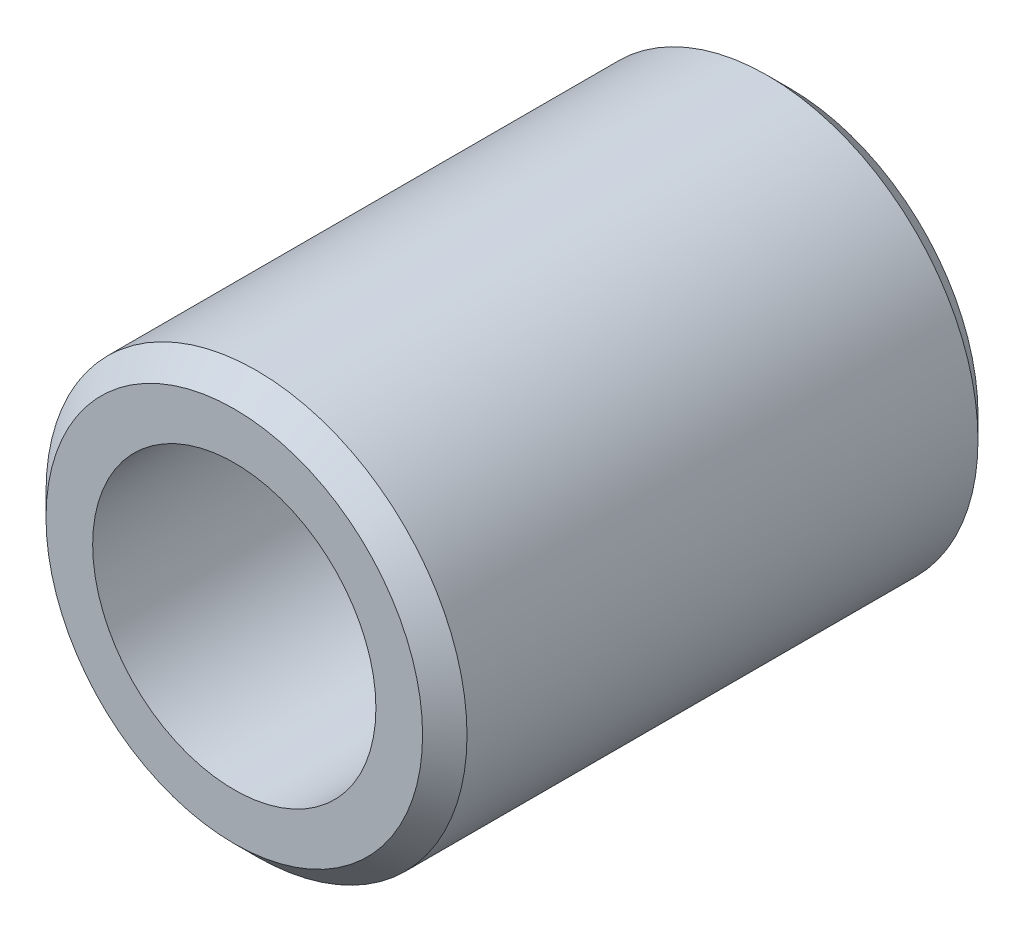
ISO-10303-21;
HEADER;
FILE_DESCRIPTION(('STEP AP214'),'2;1');
FILE_NAME('part.step','',(''),(''),'','','');
FILE_SCHEMA(('AUTOMOTIVE_DESIGN { 1 0 10303 214 1 1 1 1 }'));
ENDSEC;
DATA;
#1=APPLICATION_CONTEXT('core data for automotive mechanical design processes');
#2=APPLICATION_PROTOCOL_DEFINITION('international standard','automotive_design',2000,#1);
#3=PRODUCT_CONTEXT('',#1,'mechanical');
#4=PRODUCT('Part','Part','',(#3));
#5=PRODUCT_RELATED_PRODUCT_CATEGORY('part','',(#4));
#6=PRODUCT_DEFINITION_FORMATION('','',#4);
#7=PRODUCT_DEFINITION_CONTEXT('part definition',#1,'design');
#8=PRODUCT_DEFINITION('design','',#6,#7);
#9=PRODUCT_DEFINITION_SHAPE('','',#8);
#10=(LENGTH_UNIT() NAMED_UNIT(*) SI_UNIT(.MILLI.,.METRE.));
#11=(NAMED_UNIT(*) PLANE_ANGLE_UNIT() SI_UNIT($,.RADIAN.));
#12=(NAMED_UNIT(*) SI_UNIT($,.STERADIAN.) SOLID_ANGLE_UNIT());
#13=UNCERTAINTY_MEASURE_WITH_UNIT(LENGTH_MEASURE(1.E-05),#10,'distance_accuracy_value','');
#14=(GEOMETRIC_REPRESENTATION_CONTEXT(3) GLOBAL_UNCERTAINTY_ASSIGNED_CONTEXT((#13)) GLOBAL_UNIT_ASSIGNED_CONTEXT((#10,
#11,#12)) REPRESENTATION_CONTEXT('',''));
#15=CARTESIAN_POINT('',(0.,0.,0.));
#16=DIRECTION('',(0.,0.,1.));
#17=DIRECTION('',(1.,0.,0.));
#18=AXIS2_PLACEMENT_3D('',#15,#16,#17);
#19=CARTESIAN_POINT('',(0.,2.15265,3.175));
#20=DIRECTION('',(0.,0.,-1.));
#21=DIRECTION('',(-1.,0.,0.));
#22=AXIS2_PLACEMENT_3D('',#19,#20,#21);
#23=PLANE('',#22);
#24=CARTESIAN_POINT('',(0.,0.,3.175));
#25=DIRECTION('',(0.,0.,1.));
#26=DIRECTION('',(1.,0.,0.));
#27=AXIS2_PLACEMENT_3D('',#24,#25,#26);
#28=CIRCLE('',#27,1.61925);
#29=CARTESIAN_POINT('',(1.61925,0.,3.175));
#30=VERTEX_POINT('',#29);
#31=EDGE_CURVE('E10',#30,#30,#28,.T.);
#32=ORIENTED_EDGE('',*,*,#31,.F.);
#33=EDGE_LOOP('',(#32));
#34=FACE_BOUND('',#33,.T.);
#35=CARTESIAN_POINT('',(0.,0.,3.175));
#36=DIRECTION('',(0.,0.,1.));
#37=DIRECTION('',(1.,0.,0.));
#38=AXIS2_PLACEMENT_3D('',#35,#36,#37);
#39=CIRCLE('',#38,2.15265);
#40=CARTESIAN_POINT('',(2.15265,0.,3.175));
#41=VERTEX_POINT('',#40);
#42=EDGE_CURVE('E55',#41,#41,#39,.T.);
#43=ORIENTED_EDGE('',*,*,#42,.T.);
#44=EDGE_LOOP('',(#43));
#45=FACE_BOUND('',#44,.T.);
#46=ADVANCED_FACE('F33',(#34,#45),#23,.F.);
#47=CARTESIAN_POINT('',(0.,0.,-3.175));
#48=DIRECTION('',(0.,0.,1.));
#49=DIRECTION('',(1.,0.,0.));
#50=AXIS2_PLACEMENT_3D('',#47,#48,#49);
#51=CYLINDRICAL_SURFACE('',#50,1.61925);
#52=CARTESIAN_POINT('',(0.,0.,-3.175));
#53=DIRECTION('',(0.,0.,1.));
#54=DIRECTION('',(1.,0.,0.));
#55=AXIS2_PLACEMENT_3D('',#52,#53,#54);
#56=CIRCLE('',#55,1.61925);
#57=CARTESIAN_POINT('',(1.61925,0.,-3.175));
#58=VERTEX_POINT('',#57);
#59=EDGE_CURVE('E39',#58,#58,#56,.T.);
#60=ORIENTED_EDGE('',*,*,#59,.F.);
#61=EDGE_LOOP('',(#60));
#62=FACE_BOUND('',#61,.T.);
#63=ORIENTED_EDGE('',*,*,#31,.T.);
#64=EDGE_LOOP('',(#63));
#65=FACE_BOUND('',#64,.T.);
#66=ADVANCED_FACE('F80',(#62,#65),#51,.F.);
#67=CARTESIAN_POINT('',(0.,1.61925,-3.175));
#68=DIRECTION('',(0.,0.,1.));
#69=DIRECTION('',(1.,0.,0.));
#70=AXIS2_PLACEMENT_3D('',#67,#68,#69);
#71=PLANE('',#70);
#72=CARTESIAN_POINT('',(0.,0.,-3.175));
#73=DIRECTION('',(0.,0.,1.));
#74=DIRECTION('',(1.,0.,0.));
#75=AXIS2_PLACEMENT_3D('',#72,#73,#74);
#76=CIRCLE('',#75,2.15265);
#77=CARTESIAN_POINT('',(2.15265,0.,-3.175));
#78=VERTEX_POINT('',#77);
#79=EDGE_CURVE('E43',#78,#78,#76,.T.);
#80=ORIENTED_EDGE('',*,*,#79,.F.);
#81=EDGE_LOOP('',(#80));
#82=FACE_BOUND('',#81,.T.);
#83=ORIENTED_EDGE('',*,*,#59,.T.);
#84=EDGE_LOOP('',(#83));
#85=FACE_BOUND('',#84,.T.);
#86=ADVANCED_FACE('F75',(#82,#85),#71,.F.);
#87=CARTESIAN_POINT('',(0.,0.,-3.175));
#88=DIRECTION('',(0.,0.,1.));
#89=DIRECTION('',(1.,0.,0.));
#90=AXIS2_PLACEMENT_3D('',#87,#88,#89);
#91=CONICAL_SURFACE('',#90,2.15265,0.785398163397449);
#92=CARTESIAN_POINT('',(0.,0.,-2.921));
#93=DIRECTION('',(0.,0.,1.));
#94=DIRECTION('',(1.,0.,0.));
#95=AXIS2_PLACEMENT_3D('',#92,#93,#94);
#96=CIRCLE('',#95,2.40665);
#97=CARTESIAN_POINT('',(2.40665,0.,-2.921));
#98=VERTEX_POINT('',#97);
#99=EDGE_CURVE('E47',#98,#98,#96,.T.);
#100=ORIENTED_EDGE('',*,*,#99,.F.);
#101=EDGE_LOOP('',(#100));
#102=FACE_BOUND('',#101,.T.);
#103=ORIENTED_EDGE('',*,*,#79,.T.);
#104=EDGE_LOOP('',(#103));
#105=FACE_BOUND('',#104,.T.);
#106=ADVANCED_FACE('F69',(#102,#105),#91,.T.);
#107=CARTESIAN_POINT('',(0.,0.,-3.175));
#108=DIRECTION('',(0.,0.,1.));
#109=DIRECTION('',(1.,0.,0.));
#110=AXIS2_PLACEMENT_3D('',#107,#108,#109);
#111=CYLINDRICAL_SURFACE('',#110,2.40665);
#112=CARTESIAN_POINT('',(0.,0.,2.921));
#113=DIRECTION('',(0.,0.,1.));
#114=DIRECTION('',(1.,0.,0.));
#115=AXIS2_PLACEMENT_3D('',#112,#113,#114);
#116=CIRCLE('',#115,2.40665);
#117=CARTESIAN_POINT('',(2.40665,0.,2.921));
#118=VERTEX_POINT('',#117);
#119=EDGE_CURVE('E52',#118,#118,#116,.T.);
#120=ORIENTED_EDGE('',*,*,#119,.F.);
#121=EDGE_LOOP('',(#120));
#122=FACE_BOUND('',#121,.T.);
#123=ORIENTED_EDGE('',*,*,#99,.T.);
#124=EDGE_LOOP('',(#123));
#125=FACE_BOUND('',#124,.T.);
#126=ADVANCED_FACE('F63',(#122,#125),#111,.T.);
#127=CARTESIAN_POINT('',(0.,0.,2.921));
#128=DIRECTION('',(0.,0.,-1.));
#129=DIRECTION('',(-1.,0.,0.));
#130=AXIS2_PLACEMENT_3D('',#127,#128,#129);
#131=CONICAL_SURFACE('',#130,2.40665,0.785398163397449);
#132=ORIENTED_EDGE('',*,*,#42,.F.);
#133=EDGE_LOOP('',(#132));
#134=FACE_BOUND('',#133,.T.);
#135=ORIENTED_EDGE('',*,*,#119,.T.);
#136=EDGE_LOOP('',(#135));
#137=FACE_BOUND('',#136,.T.);
#138=ADVANCED_FACE('F60',(#134,#137),#131,.T.);
#139=CLOSED_SHELL('',(#46,#66,#86,#106,#126,#138));
#140=MANIFOLD_SOLID_BREP('B2',#139);
#141=ADVANCED_BREP_SHAPE_REPRESENTATION('',(#18,#140),#14);
#142=SHAPE_DEFINITION_REPRESENTATION(#9,#141);
ENDSEC;
END-ISO-10303-21;
